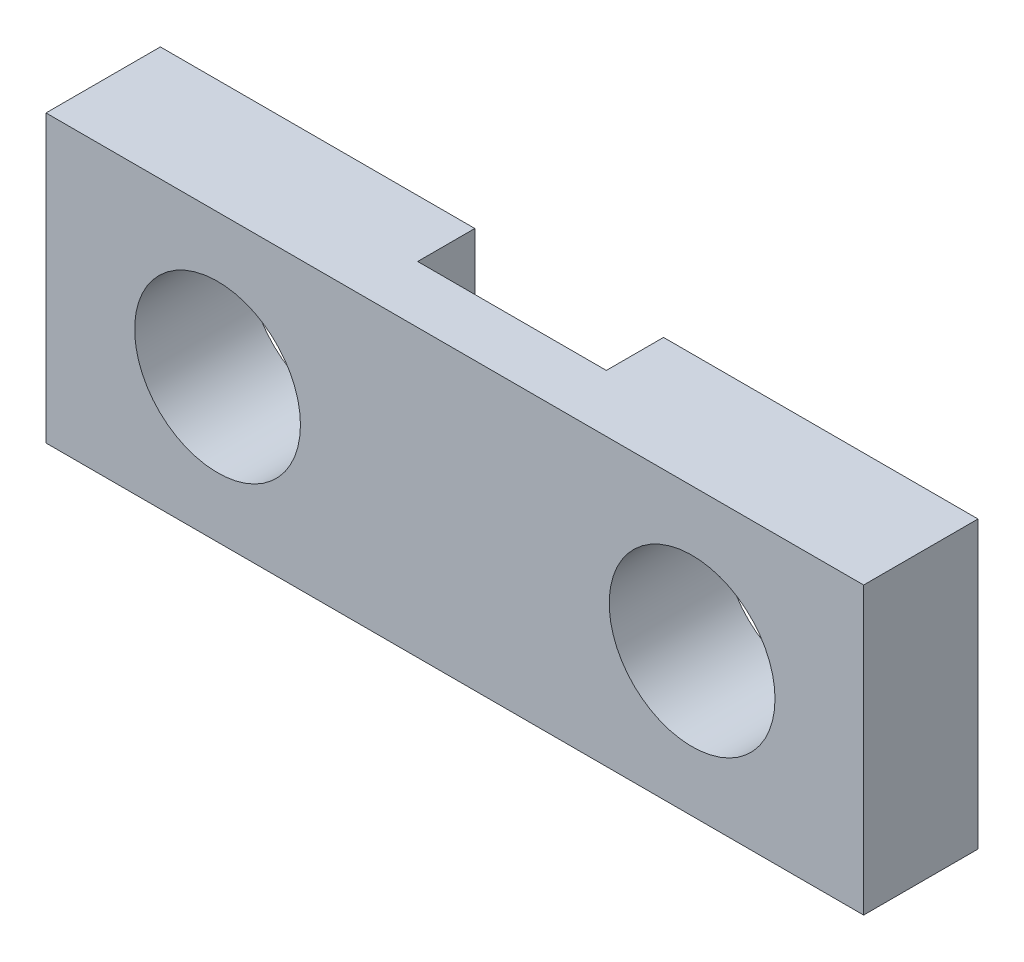
ISO-10303-21;
HEADER;
FILE_DESCRIPTION(('STEP AP214'),'2;1');
FILE_NAME('part.step','',(''),(''),'','','');
FILE_SCHEMA(('AUTOMOTIVE_DESIGN { 1 0 10303 214 1 1 1 1 }'));
ENDSEC;
DATA;
#1=APPLICATION_CONTEXT('core data for automotive mechanical design processes');
#2=APPLICATION_PROTOCOL_DEFINITION('international standard','automotive_design',2000,#1);
#3=PRODUCT_CONTEXT('',#1,'mechanical');
#4=PRODUCT('Part','Part','',(#3));
#5=PRODUCT_RELATED_PRODUCT_CATEGORY('part','',(#4));
#6=PRODUCT_DEFINITION_FORMATION('','',#4);
#7=PRODUCT_DEFINITION_CONTEXT('part definition',#1,'design');
#8=PRODUCT_DEFINITION('design','',#6,#7);
#9=PRODUCT_DEFINITION_SHAPE('','',#8);
#10=(LENGTH_UNIT() NAMED_UNIT(*) SI_UNIT(.MILLI.,.METRE.));
#11=(NAMED_UNIT(*) PLANE_ANGLE_UNIT() SI_UNIT($,.RADIAN.));
#12=(NAMED_UNIT(*) SI_UNIT($,.STERADIAN.) SOLID_ANGLE_UNIT());
#13=UNCERTAINTY_MEASURE_WITH_UNIT(LENGTH_MEASURE(1.E-05),#10,'distance_accuracy_value','');
#14=(GEOMETRIC_REPRESENTATION_CONTEXT(3) GLOBAL_UNCERTAINTY_ASSIGNED_CONTEXT((#13)) GLOBAL_UNIT_ASSIGNED_CONTEXT((#10,
#11,#12)) REPRESENTATION_CONTEXT('',''));
#15=CARTESIAN_POINT('',(0.,0.,0.));
#16=DIRECTION('',(0.,0.,1.));
#17=DIRECTION('',(1.,0.,0.));
#18=AXIS2_PLACEMENT_3D('',#15,#16,#17);
#19=CARTESIAN_POINT('',(7.15,2.5,2.));
#20=DIRECTION('',(0.,-1.,0.));
#21=DIRECTION('',(0.,0.,-1.));
#22=AXIS2_PLACEMENT_3D('',#19,#20,#21);
#23=PLANE('',#22);
#24=DIRECTION('',(0.,0.,-1.));
#25=VECTOR('',#24,1.);
#26=CARTESIAN_POINT('',(1.65,2.5,1.));
#27=LINE('',#26,#25);
#28=CARTESIAN_POINT('',(1.65,2.5,1.));
#29=VERTEX_POINT('',#28);
#30=CARTESIAN_POINT('',(1.65,2.5,0.));
#31=VERTEX_POINT('',#30);
#32=EDGE_CURVE('E133',#29,#31,#27,.T.);
#33=ORIENTED_EDGE('',*,*,#32,.F.);
#34=DIRECTION('',(-1.,0.,0.));
#35=VECTOR('',#34,1.);
#36=CARTESIAN_POINT('',(1.65,2.5,1.));
#37=LINE('',#36,#35);
#38=CARTESIAN_POINT('',(-1.65,2.5,1.));
#39=VERTEX_POINT('',#38);
#40=EDGE_CURVE('E118',#29,#39,#37,.T.);
#41=ORIENTED_EDGE('',*,*,#40,.T.);
#42=DIRECTION('',(0.,0.,-1.));
#43=VECTOR('',#42,1.);
#44=CARTESIAN_POINT('',(-1.65,2.5,1.));
#45=LINE('',#44,#43);
#46=CARTESIAN_POINT('',(-1.65,2.5,0.));
#47=VERTEX_POINT('',#46);
#48=EDGE_CURVE('E114',#39,#47,#45,.T.);
#49=ORIENTED_EDGE('',*,*,#48,.T.);
#50=DIRECTION('',(-1.,0.,0.));
#51=VECTOR('',#50,1.);
#52=CARTESIAN_POINT('',(7.15,2.5,0.));
#53=LINE('',#52,#51);
#54=CARTESIAN_POINT('',(-7.15,2.5,0.));
#55=VERTEX_POINT('',#54);
#56=EDGE_CURVE('E149',#47,#55,#53,.T.);
#57=ORIENTED_EDGE('',*,*,#56,.T.);
#58=DIRECTION('',(0.,0.,-1.));
#59=VECTOR('',#58,1.);
#60=CARTESIAN_POINT('',(-7.15,2.5,2.));
#61=LINE('',#60,#59);
#62=CARTESIAN_POINT('',(-7.15,2.5,2.));
#63=VERTEX_POINT('',#62);
#64=EDGE_CURVE('E47',#63,#55,#61,.T.);
#65=ORIENTED_EDGE('',*,*,#64,.F.);
#66=DIRECTION('',(-1.,0.,0.));
#67=VECTOR('',#66,1.);
#68=CARTESIAN_POINT('',(7.15,2.5,2.));
#69=LINE('',#68,#67);
#70=CARTESIAN_POINT('',(7.15,2.5,2.));
#71=VERTEX_POINT('',#70);
#72=EDGE_CURVE('E89',#71,#63,#69,.T.);
#73=ORIENTED_EDGE('',*,*,#72,.F.);
#74=DIRECTION('',(0.,0.,-1.));
#75=VECTOR('',#74,1.);
#76=CARTESIAN_POINT('',(7.15,2.5,2.));
#77=LINE('',#76,#75);
#78=CARTESIAN_POINT('',(7.15,2.5,0.));
#79=VERTEX_POINT('',#78);
#80=EDGE_CURVE('E11',#71,#79,#77,.T.);
#81=ORIENTED_EDGE('',*,*,#80,.T.);
#82=EDGE_CURVE('E151',#79,#31,#53,.T.);
#83=ORIENTED_EDGE('',*,*,#82,.T.);
#84=EDGE_LOOP('',(#33,#41,#49,#57,#65,#73,#81,#83));
#85=FACE_BOUND('',#84,.T.);
#86=ADVANCED_FACE('F39',(#85),#23,.F.);
#87=CARTESIAN_POINT('',(7.15,-2.5,2.));
#88=DIRECTION('',(0.,-1.,0.));
#89=DIRECTION('',(0.,0.,-1.));
#90=AXIS2_PLACEMENT_3D('',#87,#88,#89);
#91=PLANE('',#90);
#92=DIRECTION('',(-1.,0.,0.));
#93=VECTOR('',#92,1.);
#94=CARTESIAN_POINT('',(1.65,-2.5,1.));
#95=LINE('',#94,#93);
#96=CARTESIAN_POINT('',(1.65,-2.5,1.));
#97=VERTEX_POINT('',#96);
#98=CARTESIAN_POINT('',(-1.65,-2.5,1.));
#99=VERTEX_POINT('',#98);
#100=EDGE_CURVE('E119',#97,#99,#95,.T.);
#101=ORIENTED_EDGE('',*,*,#100,.F.);
#102=DIRECTION('',(0.,0.,-1.));
#103=VECTOR('',#102,1.);
#104=CARTESIAN_POINT('',(1.65,-2.5,1.));
#105=LINE('',#104,#103);
#106=CARTESIAN_POINT('',(1.65,-2.5,0.));
#107=VERTEX_POINT('',#106);
#108=EDGE_CURVE('E150',#97,#107,#105,.T.);
#109=ORIENTED_EDGE('',*,*,#108,.T.);
#110=DIRECTION('',(-1.,0.,0.));
#111=VECTOR('',#110,1.);
#112=CARTESIAN_POINT('',(7.15,-2.5,0.));
#113=LINE('',#112,#111);
#114=CARTESIAN_POINT('',(7.15,-2.5,0.));
#115=VERTEX_POINT('',#114);
#116=EDGE_CURVE('E140',#115,#107,#113,.T.);
#117=ORIENTED_EDGE('',*,*,#116,.F.);
#118=DIRECTION('',(0.,0.,-1.));
#119=VECTOR('',#118,1.);
#120=CARTESIAN_POINT('',(7.15,-2.5,2.));
#121=LINE('',#120,#119);
#122=CARTESIAN_POINT('',(7.15,-2.5,2.));
#123=VERTEX_POINT('',#122);
#124=EDGE_CURVE('E63',#123,#115,#121,.T.);
#125=ORIENTED_EDGE('',*,*,#124,.F.);
#126=DIRECTION('',(-1.,0.,0.));
#127=VECTOR('',#126,1.);
#128=CARTESIAN_POINT('',(7.15,-2.5,2.));
#129=LINE('',#128,#127);
#130=CARTESIAN_POINT('',(-7.15,-2.5,2.));
#131=VERTEX_POINT('',#130);
#132=EDGE_CURVE('E145',#123,#131,#129,.T.);
#133=ORIENTED_EDGE('',*,*,#132,.T.);
#134=DIRECTION('',(0.,0.,-1.));
#135=VECTOR('',#134,1.);
#136=CARTESIAN_POINT('',(-7.15,-2.5,2.));
#137=LINE('',#136,#135);
#138=CARTESIAN_POINT('',(-7.15,-2.5,0.));
#139=VERTEX_POINT('',#138);
#140=EDGE_CURVE('E160',#131,#139,#137,.T.);
#141=ORIENTED_EDGE('',*,*,#140,.T.);
#142=CARTESIAN_POINT('',(-1.65,-2.5,0.));
#143=VERTEX_POINT('',#142);
#144=EDGE_CURVE('E131',#143,#139,#113,.T.);
#145=ORIENTED_EDGE('',*,*,#144,.F.);
#146=DIRECTION('',(0.,0.,-1.));
#147=VECTOR('',#146,1.);
#148=CARTESIAN_POINT('',(-1.65,-2.5,1.));
#149=LINE('',#148,#147);
#150=EDGE_CURVE('E54',#99,#143,#149,.T.);
#151=ORIENTED_EDGE('',*,*,#150,.F.);
#152=EDGE_LOOP('',(#101,#109,#117,#125,#133,#141,#145,#151));
#153=FACE_BOUND('',#152,.T.);
#154=ADVANCED_FACE('F129',(#153),#91,.T.);
#155=CARTESIAN_POINT('',(0.,0.,0.));
#156=DIRECTION('',(0.,0.,1.));
#157=DIRECTION('',(1.,0.,0.));
#158=AXIS2_PLACEMENT_3D('',#155,#156,#157);
#159=PLANE('',#158);
#160=CARTESIAN_POINT('',(4.15,0.,0.));
#161=DIRECTION('',(0.,0.,1.));
#162=DIRECTION('',(1.,0.,0.));
#163=AXIS2_PLACEMENT_3D('',#160,#161,#162);
#164=CIRCLE('',#163,1.45);
#165=CARTESIAN_POINT('',(5.6,0.,0.));
#166=VERTEX_POINT('',#165);
#167=EDGE_CURVE('E180',#166,#166,#164,.T.);
#168=ORIENTED_EDGE('',*,*,#167,.T.);
#169=EDGE_LOOP('',(#168));
#170=FACE_BOUND('',#169,.T.);
#171=DIRECTION('',(0.,1.,0.));
#172=VECTOR('',#171,1.);
#173=CARTESIAN_POINT('',(1.65,-2.5,0.));
#174=LINE('',#173,#172);
#175=EDGE_CURVE('E126',#107,#31,#174,.T.);
#176=ORIENTED_EDGE('',*,*,#175,.T.);
#177=ORIENTED_EDGE('',*,*,#82,.F.);
#178=DIRECTION('',(0.,1.,0.));
#179=VECTOR('',#178,1.);
#180=CARTESIAN_POINT('',(7.15,-2.5,0.));
#181=LINE('',#180,#179);
#182=EDGE_CURVE('E147',#115,#79,#181,.T.);
#183=ORIENTED_EDGE('',*,*,#182,.F.);
#184=ORIENTED_EDGE('',*,*,#116,.T.);
#185=EDGE_LOOP('',(#176,#177,#183,#184));
#186=FACE_BOUND('',#185,.T.);
#187=ADVANCED_FACE('F177',(#170,#186),#159,.F.);
#188=CARTESIAN_POINT('',(7.15,-2.5,2.));
#189=DIRECTION('',(-1.,0.,0.));
#190=DIRECTION('',(0.,0.,1.));
#191=AXIS2_PLACEMENT_3D('',#188,#189,#190);
#192=PLANE('',#191);
#193=ORIENTED_EDGE('',*,*,#182,.T.);
#194=ORIENTED_EDGE('',*,*,#80,.F.);
#195=DIRECTION('',(0.,1.,0.));
#196=VECTOR('',#195,1.);
#197=CARTESIAN_POINT('',(7.15,-2.5,2.));
#198=LINE('',#197,#196);
#199=EDGE_CURVE('E138',#123,#71,#198,.T.);
#200=ORIENTED_EDGE('',*,*,#199,.F.);
#201=ORIENTED_EDGE('',*,*,#124,.T.);
#202=EDGE_LOOP('',(#193,#194,#200,#201));
#203=FACE_BOUND('',#202,.T.);
#204=ADVANCED_FACE('F41',(#203),#192,.F.);
#205=CARTESIAN_POINT('',(-7.15,-2.5,2.));
#206=DIRECTION('',(-1.,0.,0.));
#207=DIRECTION('',(0.,0.,1.));
#208=AXIS2_PLACEMENT_3D('',#205,#206,#207);
#209=PLANE('',#208);
#210=DIRECTION('',(0.,1.,0.));
#211=VECTOR('',#210,1.);
#212=CARTESIAN_POINT('',(-7.15,-2.5,0.));
#213=LINE('',#212,#211);
#214=EDGE_CURVE('E154',#139,#55,#213,.T.);
#215=ORIENTED_EDGE('',*,*,#214,.F.);
#216=ORIENTED_EDGE('',*,*,#140,.F.);
#217=DIRECTION('',(0.,1.,0.));
#218=VECTOR('',#217,1.);
#219=CARTESIAN_POINT('',(-7.15,-2.5,2.));
#220=LINE('',#219,#218);
#221=EDGE_CURVE('E142',#131,#63,#220,.T.);
#222=ORIENTED_EDGE('',*,*,#221,.T.);
#223=ORIENTED_EDGE('',*,*,#64,.T.);
#224=EDGE_LOOP('',(#215,#216,#222,#223));
#225=FACE_BOUND('',#224,.T.);
#226=ADVANCED_FACE('F164',(#225),#209,.T.);
#227=CARTESIAN_POINT('',(0.,0.,2.));
#228=DIRECTION('',(0.,0.,1.));
#229=DIRECTION('',(1.,0.,0.));
#230=AXIS2_PLACEMENT_3D('',#227,#228,#229);
#231=PLANE('',#230);
#232=CARTESIAN_POINT('',(-4.15,0.,2.));
#233=DIRECTION('',(0.,0.,1.));
#234=DIRECTION('',(1.,0.,0.));
#235=AXIS2_PLACEMENT_3D('',#232,#233,#234);
#236=CIRCLE('',#235,1.45);
#237=CARTESIAN_POINT('',(-2.7,0.,2.));
#238=VERTEX_POINT('',#237);
#239=EDGE_CURVE('E194',#238,#238,#236,.T.);
#240=ORIENTED_EDGE('',*,*,#239,.F.);
#241=EDGE_LOOP('',(#240));
#242=FACE_BOUND('',#241,.T.);
#243=CARTESIAN_POINT('',(4.15,0.,2.));
#244=DIRECTION('',(0.,0.,1.));
#245=DIRECTION('',(1.,0.,0.));
#246=AXIS2_PLACEMENT_3D('',#243,#244,#245);
#247=CIRCLE('',#246,1.45);
#248=CARTESIAN_POINT('',(5.6,0.,2.));
#249=VERTEX_POINT('',#248);
#250=EDGE_CURVE('E188',#249,#249,#247,.T.);
#251=ORIENTED_EDGE('',*,*,#250,.F.);
#252=EDGE_LOOP('',(#251));
#253=FACE_BOUND('',#252,.T.);
#254=ORIENTED_EDGE('',*,*,#199,.T.);
#255=ORIENTED_EDGE('',*,*,#72,.T.);
#256=ORIENTED_EDGE('',*,*,#221,.F.);
#257=ORIENTED_EDGE('',*,*,#132,.F.);
#258=EDGE_LOOP('',(#254,#255,#256,#257));
#259=FACE_BOUND('',#258,.T.);
#260=ADVANCED_FACE('F172',(#242,#253,#259),#231,.T.);
#261=CARTESIAN_POINT('',(-4.15,0.,0.));
#262=DIRECTION('',(0.,0.,1.));
#263=DIRECTION('',(1.,0.,0.));
#264=AXIS2_PLACEMENT_3D('',#261,#262,#263);
#265=CIRCLE('',#264,1.45);
#266=CARTESIAN_POINT('',(-2.7,0.,0.));
#267=VERTEX_POINT('',#266);
#268=EDGE_CURVE('E191',#267,#267,#265,.T.);
#269=ORIENTED_EDGE('',*,*,#268,.T.);
#270=EDGE_LOOP('',(#269));
#271=FACE_BOUND('',#270,.T.);
#272=ORIENTED_EDGE('',*,*,#56,.F.);
#273=DIRECTION('',(0.,1.,0.));
#274=VECTOR('',#273,1.);
#275=CARTESIAN_POINT('',(-1.65,-2.5,0.));
#276=LINE('',#275,#274);
#277=EDGE_CURVE('E169',#143,#47,#276,.T.);
#278=ORIENTED_EDGE('',*,*,#277,.F.);
#279=ORIENTED_EDGE('',*,*,#144,.T.);
#280=ORIENTED_EDGE('',*,*,#214,.T.);
#281=EDGE_LOOP('',(#272,#278,#279,#280));
#282=FACE_BOUND('',#281,.T.);
#283=ADVANCED_FACE('F168',(#271,#282),#159,.F.);
#284=CARTESIAN_POINT('',(1.65,-2.5,1.));
#285=DIRECTION('',(-1.,0.,0.));
#286=DIRECTION('',(0.,0.,1.));
#287=AXIS2_PLACEMENT_3D('',#284,#285,#286);
#288=PLANE('',#287);
#289=ORIENTED_EDGE('',*,*,#175,.F.);
#290=ORIENTED_EDGE('',*,*,#108,.F.);
#291=DIRECTION('',(0.,1.,0.));
#292=VECTOR('',#291,1.);
#293=CARTESIAN_POINT('',(1.65,-2.5,1.));
#294=LINE('',#293,#292);
#295=EDGE_CURVE('E124',#97,#29,#294,.T.);
#296=ORIENTED_EDGE('',*,*,#295,.T.);
#297=ORIENTED_EDGE('',*,*,#32,.T.);
#298=EDGE_LOOP('',(#289,#290,#296,#297));
#299=FACE_BOUND('',#298,.T.);
#300=ADVANCED_FACE('F183',(#299),#288,.T.);
#301=CARTESIAN_POINT('',(-1.65,-2.5,1.));
#302=DIRECTION('',(-1.,0.,0.));
#303=DIRECTION('',(0.,0.,1.));
#304=AXIS2_PLACEMENT_3D('',#301,#302,#303);
#305=PLANE('',#304);
#306=ORIENTED_EDGE('',*,*,#277,.T.);
#307=ORIENTED_EDGE('',*,*,#48,.F.);
#308=DIRECTION('',(0.,1.,0.));
#309=VECTOR('',#308,1.);
#310=CARTESIAN_POINT('',(-1.65,-2.5,1.));
#311=LINE('',#310,#309);
#312=EDGE_CURVE('E110',#99,#39,#311,.T.);
#313=ORIENTED_EDGE('',*,*,#312,.F.);
#314=ORIENTED_EDGE('',*,*,#150,.T.);
#315=EDGE_LOOP('',(#306,#307,#313,#314));
#316=FACE_BOUND('',#315,.T.);
#317=ADVANCED_FACE('F112',(#316),#305,.F.);
#318=CARTESIAN_POINT('',(0.,0.,1.));
#319=DIRECTION('',(0.,0.,-1.));
#320=DIRECTION('',(-1.,0.,0.));
#321=AXIS2_PLACEMENT_3D('',#318,#319,#320);
#322=PLANE('',#321);
#323=ORIENTED_EDGE('',*,*,#100,.T.);
#324=ORIENTED_EDGE('',*,*,#312,.T.);
#325=ORIENTED_EDGE('',*,*,#40,.F.);
#326=ORIENTED_EDGE('',*,*,#295,.F.);
#327=EDGE_LOOP('',(#323,#324,#325,#326));
#328=FACE_BOUND('',#327,.T.);
#329=ADVANCED_FACE('F123',(#328),#322,.T.);
#330=CARTESIAN_POINT('',(4.15,0.,2.));
#331=DIRECTION('',(0.,0.,1.));
#332=DIRECTION('',(1.,0.,0.));
#333=AXIS2_PLACEMENT_3D('',#330,#331,#332);
#334=CYLINDRICAL_SURFACE('',#333,1.45);
#335=ORIENTED_EDGE('',*,*,#167,.F.);
#336=EDGE_LOOP('',(#335));
#337=FACE_BOUND('',#336,.T.);
#338=ORIENTED_EDGE('',*,*,#250,.T.);
#339=EDGE_LOOP('',(#338));
#340=FACE_BOUND('',#339,.T.);
#341=ADVANCED_FACE('F205',(#337,#340),#334,.F.);
#342=CARTESIAN_POINT('',(-4.15,0.,2.));
#343=DIRECTION('',(0.,0.,1.));
#344=DIRECTION('',(1.,0.,0.));
#345=AXIS2_PLACEMENT_3D('',#342,#343,#344);
#346=CYLINDRICAL_SURFACE('',#345,1.45);
#347=ORIENTED_EDGE('',*,*,#268,.F.);
#348=EDGE_LOOP('',(#347));
#349=FACE_BOUND('',#348,.T.);
#350=ORIENTED_EDGE('',*,*,#239,.T.);
#351=EDGE_LOOP('',(#350));
#352=FACE_BOUND('',#351,.T.);
#353=ADVANCED_FACE('F198',(#349,#352),#346,.F.);
#354=CLOSED_SHELL('',(#86,#154,#187,#204,#226,#260,#283,#300,#317,#329,#341,#353));
#355=MANIFOLD_SOLID_BREP('B2',#354);
#356=ADVANCED_BREP_SHAPE_REPRESENTATION('',(#18,#355),#14);
#357=SHAPE_DEFINITION_REPRESENTATION(#9,#356);
ENDSEC;
END-ISO-10303-21;
